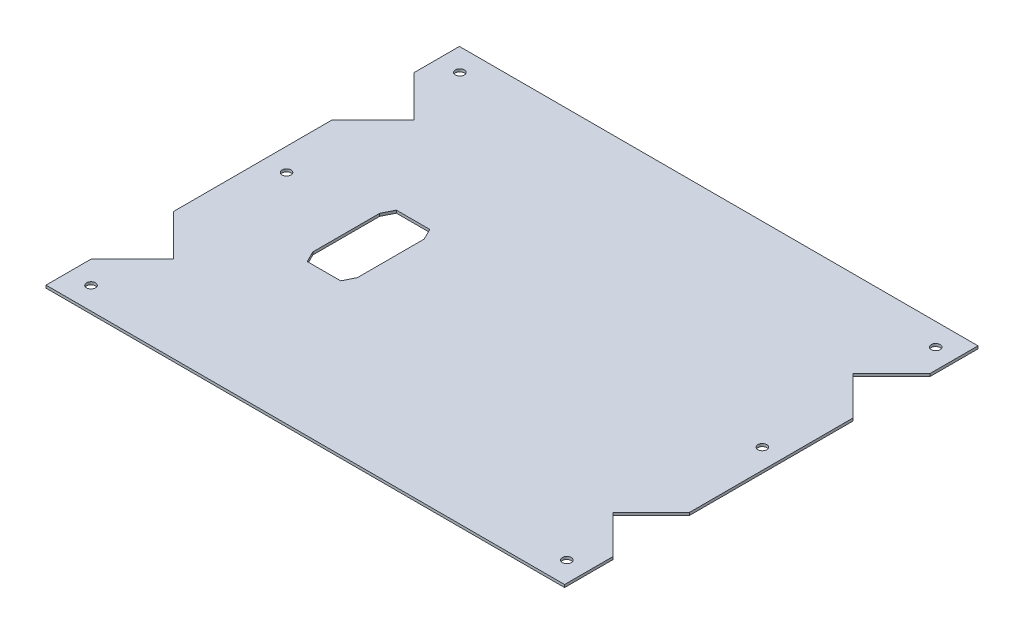
ISO-10303-21;
HEADER;
FILE_DESCRIPTION(('STEP AP214'),'2;1');
FILE_NAME('part.step','',(''),(''),'','','');
FILE_SCHEMA(('AUTOMOTIVE_DESIGN { 1 0 10303 214 1 1 1 1 }'));
ENDSEC;
DATA;
#1=APPLICATION_CONTEXT('core data for automotive mechanical design processes');
#2=APPLICATION_PROTOCOL_DEFINITION('international standard','automotive_design',2000,#1);
#3=PRODUCT_CONTEXT('',#1,'mechanical');
#4=PRODUCT('Part','Part','',(#3));
#5=PRODUCT_RELATED_PRODUCT_CATEGORY('part','',(#4));
#6=PRODUCT_DEFINITION_FORMATION('','',#4);
#7=PRODUCT_DEFINITION_CONTEXT('part definition',#1,'design');
#8=PRODUCT_DEFINITION('design','',#6,#7);
#9=PRODUCT_DEFINITION_SHAPE('','',#8);
#10=(LENGTH_UNIT() NAMED_UNIT(*) SI_UNIT(.MILLI.,.METRE.));
#11=(NAMED_UNIT(*) PLANE_ANGLE_UNIT() SI_UNIT($,.RADIAN.));
#12=(NAMED_UNIT(*) SI_UNIT($,.STERADIAN.) SOLID_ANGLE_UNIT());
#13=UNCERTAINTY_MEASURE_WITH_UNIT(LENGTH_MEASURE(1.E-05),#10,'distance_accuracy_value','');
#14=(GEOMETRIC_REPRESENTATION_CONTEXT(3) GLOBAL_UNCERTAINTY_ASSIGNED_CONTEXT((#13)) GLOBAL_UNIT_ASSIGNED_CONTEXT((#10,
#11,#12)) REPRESENTATION_CONTEXT('',''));
#15=CARTESIAN_POINT('',(0.,0.,0.));
#16=DIRECTION('',(0.,0.,1.));
#17=DIRECTION('',(1.,0.,0.));
#18=AXIS2_PLACEMENT_3D('',#15,#16,#17);
#19=CARTESIAN_POINT('',(0.,1.2,0.));
#20=DIRECTION('',(0.,-1.,0.));
#21=DIRECTION('',(0.,0.,-1.));
#22=AXIS2_PLACEMENT_3D('',#19,#20,#21);
#23=PLANE('',#22);
#24=DIRECTION('',(0.707106781186555,0.,0.70710678118654));
#25=VECTOR('',#24,1.);
#26=CARTESIAN_POINT('',(-8.29720542096546,1.19999999999937,-10.8767766953194));
#27=LINE('',#26,#25);
#28=CARTESIAN_POINT('',(-16.9739821162847,1.19999999999928,-19.5535533906384));
#29=VERTEX_POINT('',#28);
#30=CARTESIAN_POINT('',(1.46656233249632,1.19999999999947,-1.1130089418578));
#31=VERTEX_POINT('',#30);
#32=EDGE_CURVE('E726',#29,#31,#27,.T.);
#33=ORIENTED_EDGE('',*,*,#32,.T.);
#34=DIRECTION('',(-0.707106781186548,0.,0.707106781186547));
#35=VECTOR('',#34,1.);
#36=CARTESIAN_POINT('',(-27.1972054209779,1.19999999999882,27.5507588116164));
#37=LINE('',#36,#35);
#38=CARTESIAN_POINT('',(-16.9739821162848,1.19999999999885,17.3275355069233));
#39=VERTEX_POINT('',#38);
#40=EDGE_CURVE('E614',#31,#39,#37,.T.);
#41=ORIENTED_EDGE('',*,*,#40,.T.);
#42=DIRECTION('',(0.,0.,1.));
#43=VECTOR('',#42,1.);
#44=CARTESIAN_POINT('',(-16.9739821162848,1.19999999999878,37.7739821163095));
#45=LINE('',#44,#43);
#46=CARTESIAN_POINT('',(-16.9739821162848,1.19999999999878,37.7739821163095));
#47=VERTEX_POINT('',#46);
#48=EDGE_CURVE('E628',#47,#39,#45,.F.);
#49=ORIENTED_EDGE('',*,*,#48,.F.);
#50=DIRECTION('',(1.,0.,0.));
#51=VECTOR('',#50,1.);
#52=CARTESIAN_POINT('',(215.773982116274,1.19999999999876,37.7739821163095));
#53=LINE('',#52,#51);
#54=CARTESIAN_POINT('',(215.773982116274,1.19999999999876,37.7739821163092));
#55=VERTEX_POINT('',#54);
#56=EDGE_CURVE('E617',#47,#55,#53,.T.);
#57=ORIENTED_EDGE('',*,*,#56,.T.);
#58=DIRECTION('',(0.,0.,-1.));
#59=VECTOR('',#58,1.);
#60=CARTESIAN_POINT('',(215.773982116274,1.19999999999956,-0.0260178836905514));
#61=LINE('',#60,#59);
#62=CARTESIAN_POINT('',(215.773982116274,1.19999999999923,16.1275355069061));
#63=VERTEX_POINT('',#62);
#64=EDGE_CURVE('E637',#63,#55,#61,.F.);
#65=ORIENTED_EDGE('',*,*,#64,.F.);
#66=DIRECTION('',(-0.70710678118656,0.,-0.707106781186535));
#67=VECTOR('',#66,1.);
#68=CARTESIAN_POINT('',(207.697205420976,1.19999999999942,8.05075881160807));
#69=LINE('',#68,#67);
#70=CARTESIAN_POINT('',(198.533437667526,1.19999999999961,-1.11300894184206));
#71=VERTEX_POINT('',#70);
#72=EDGE_CURVE('E620',#63,#71,#69,.T.);
#73=ORIENTED_EDGE('',*,*,#72,.T.);
#74=DIRECTION('',(0.707106781186543,0.,-0.707106781186552));
#75=VECTOR('',#74,1.);
#76=CARTESIAN_POINT('',(260.497205420979,1.1999999999997,-63.0767766952964));
#77=LINE('',#76,#75);
#78=CARTESIAN_POINT('',(215.773982116275,1.19999999999945,-18.3535533905913));
#79=VERTEX_POINT('',#78);
#80=EDGE_CURVE('E700',#71,#79,#77,.T.);
#81=ORIENTED_EDGE('',*,*,#80,.T.);
#82=DIRECTION('',(0.,0.,-1.));
#83=VECTOR('',#82,1.);
#84=CARTESIAN_POINT('',(215.773982116275,1.20000000000006,-107.8));
#85=LINE('',#84,#83);
#86=CARTESIAN_POINT('',(215.773982116275,1.19999999999995,-91.6464466094031));
#87=VERTEX_POINT('',#86);
#88=EDGE_CURVE('E709',#87,#79,#85,.F.);
#89=ORIENTED_EDGE('',*,*,#88,.F.);
#90=DIRECTION('',(-0.707106781186554,0.,-0.707106781186541));
#91=VECTOR('',#90,1.);
#92=CARTESIAN_POINT('',(207.697205420976,1.20000000000003,-99.7232233047014));
#93=LINE('',#92,#91);
#94=CARTESIAN_POINT('',(198.533437667532,1.20000000000009,-108.886991058146));
#95=VERTEX_POINT('',#94);
#96=EDGE_CURVE('E698',#87,#95,#93,.T.);
#97=ORIENTED_EDGE('',*,*,#96,.T.);
#98=DIRECTION('',(0.707106781186549,0.,-0.707106781186546));
#99=VECTOR('',#98,1.);
#100=CARTESIAN_POINT('',(226.597205420989,1.19999999999951,-136.950758811603));
#101=LINE('',#100,#99);
#102=CARTESIAN_POINT('',(215.773982116275,1.19999999999962,-126.127535506889));
#103=VERTEX_POINT('',#102);
#104=EDGE_CURVE('E593',#95,#103,#101,.T.);
#105=ORIENTED_EDGE('',*,*,#104,.T.);
#106=DIRECTION('',(0.,0.,-1.));
#107=VECTOR('',#106,1.);
#108=CARTESIAN_POINT('',(215.773982116275,1.19999999999947,-147.773982116317));
#109=LINE('',#108,#107);
#110=CARTESIAN_POINT('',(215.773982116275,1.19999999999947,-147.773982116317));
#111=VERTEX_POINT('',#110);
#112=EDGE_CURVE('E663',#111,#103,#109,.F.);
#113=ORIENTED_EDGE('',*,*,#112,.F.);
#114=DIRECTION('',(1.,0.,0.));
#115=VECTOR('',#114,1.);
#116=CARTESIAN_POINT('',(215.773982116275,1.19999999999947,-147.773982116317));
#117=LINE('',#116,#115);
#118=CARTESIAN_POINT('',(-16.9739821162845,1.19999999999817,-147.773982116316));
#119=VERTEX_POINT('',#118);
#120=EDGE_CURVE('E659',#111,#119,#117,.F.);
#121=ORIENTED_EDGE('',*,*,#120,.T.);
#122=DIRECTION('',(0.,0.,1.));
#123=VECTOR('',#122,1.);
#124=CARTESIAN_POINT('',(-16.9739821162845,1.19999999999909,-109.973982116317));
#125=LINE('',#124,#123);
#126=CARTESIAN_POINT('',(-16.9739821162845,1.19999999999867,-127.327535506915));
#127=VERTEX_POINT('',#126);
#128=EDGE_CURVE('E674',#127,#119,#125,.F.);
#129=ORIENTED_EDGE('',*,*,#128,.F.);
#130=DIRECTION('',(0.707106781186561,0.,0.707106781186534));
#131=VECTOR('',#130,1.);
#132=CARTESIAN_POINT('',(-8.29720542098548,1.19999999999888,-118.650758811616));
#133=LINE('',#132,#131);
#134=CARTESIAN_POINT('',(1.46656233246933,1.19999999999911,-108.886991058161));
#135=VERTEX_POINT('',#134);
#136=EDGE_CURVE('E657',#127,#135,#133,.T.);
#137=ORIENTED_EDGE('',*,*,#136,.T.);
#138=DIRECTION('',(-0.707106781186541,0.,0.707106781186554));
#139=VECTOR('',#138,1.);
#140=CARTESIAN_POINT('',(-61.0972054209882,1.19999999999901,-46.3232233047028));
#141=LINE('',#140,#139);
#142=CARTESIAN_POINT('',(-16.9739821162847,1.19999999999854,-90.4464466094071));
#143=VERTEX_POINT('',#142);
#144=EDGE_CURVE('E728',#135,#143,#141,.T.);
#145=ORIENTED_EDGE('',*,*,#144,.T.);
#146=DIRECTION('',(0.,0.,1.));
#147=VECTOR('',#146,1.);
#148=CARTESIAN_POINT('',(-16.9739821162847,1.19999999999947,-2.2));
#149=LINE('',#148,#147);
#150=EDGE_CURVE('E734',#29,#143,#149,.F.);
#151=ORIENTED_EDGE('',*,*,#150,.F.);
#152=EDGE_LOOP('',(#33,#41,#49,#57,#65,#73,#81,#89,#97,#105,#113,#121,#129,#137,#145,#151));
#153=FACE_BOUND('',#152,.T.);
#154=DIRECTION('',(-0.447213595499958,0.,0.894427190999916));
#155=VECTOR('',#154,1.);
#156=CARTESIAN_POINT('',(30.,1.2,-65.));
#157=LINE('',#156,#155);
#158=CARTESIAN_POINT('',(32.5,1.2,-70.));
#159=VERTEX_POINT('',#158);
#160=CARTESIAN_POINT('',(30.,1.2,-65.));
#161=VERTEX_POINT('',#160);
#162=EDGE_CURVE('E738',#159,#161,#157,.T.);
#163=ORIENTED_EDGE('',*,*,#162,.F.);
#164=DIRECTION('',(-1.,0.,0.));
#165=VECTOR('',#164,1.);
#166=CARTESIAN_POINT('',(32.5,1.2,-70.));
#167=LINE('',#166,#165);
#168=CARTESIAN_POINT('',(47.5,1.2,-70.));
#169=VERTEX_POINT('',#168);
#170=EDGE_CURVE('E753',#169,#159,#167,.T.);
#171=ORIENTED_EDGE('',*,*,#170,.F.);
#172=DIRECTION('',(-0.447213595499958,0.,-0.894427190999916));
#173=VECTOR('',#172,1.);
#174=CARTESIAN_POINT('',(47.5,1.2,-70.));
#175=LINE('',#174,#173);
#176=CARTESIAN_POINT('',(50.,1.2,-65.));
#177=VERTEX_POINT('',#176);
#178=EDGE_CURVE('E751',#177,#169,#175,.T.);
#179=ORIENTED_EDGE('',*,*,#178,.F.);
#180=DIRECTION('',(0.,0.,-1.));
#181=VECTOR('',#180,1.);
#182=CARTESIAN_POINT('',(50.,1.2,-65.));
#183=LINE('',#182,#181);
#184=CARTESIAN_POINT('',(50.,1.2,-35.));
#185=VERTEX_POINT('',#184);
#186=EDGE_CURVE('E749',#185,#177,#183,.T.);
#187=ORIENTED_EDGE('',*,*,#186,.F.);
#188=DIRECTION('',(0.447213595499959,0.,-0.894427190999915));
#189=VECTOR('',#188,1.);
#190=CARTESIAN_POINT('',(50.,1.2,-35.));
#191=LINE('',#190,#189);
#192=CARTESIAN_POINT('',(47.5,1.2,-30.));
#193=VERTEX_POINT('',#192);
#194=EDGE_CURVE('E747',#193,#185,#191,.T.);
#195=ORIENTED_EDGE('',*,*,#194,.F.);
#196=DIRECTION('',(1.,0.,0.));
#197=VECTOR('',#196,1.);
#198=CARTESIAN_POINT('',(47.5,1.2,-30.));
#199=LINE('',#198,#197);
#200=CARTESIAN_POINT('',(32.5,1.2,-30.));
#201=VERTEX_POINT('',#200);
#202=EDGE_CURVE('E745',#201,#193,#199,.T.);
#203=ORIENTED_EDGE('',*,*,#202,.F.);
#204=DIRECTION('',(0.447213595499958,0.,0.894427190999916));
#205=VECTOR('',#204,1.);
#206=CARTESIAN_POINT('',(32.5,1.2,-30.));
#207=LINE('',#206,#205);
#208=CARTESIAN_POINT('',(30.,1.2,-35.));
#209=VERTEX_POINT('',#208);
#210=EDGE_CURVE('E743',#209,#201,#207,.T.);
#211=ORIENTED_EDGE('',*,*,#210,.F.);
#212=DIRECTION('',(0.,0.,1.));
#213=VECTOR('',#212,1.);
#214=CARTESIAN_POINT('',(30.,1.2,-65.));
#215=LINE('',#214,#213);
#216=EDGE_CURVE('E740',#161,#209,#215,.T.);
#217=ORIENTED_EDGE('',*,*,#216,.F.);
#218=EDGE_LOOP('',(#163,#171,#179,#187,#195,#203,#211,#217));
#219=FACE_BOUND('',#218,.T.);
#220=CARTESIAN_POINT('',(-6.77398211619506,1.19999999999886,-59.9999999999999));
#221=DIRECTION('',(0.,1.,0.));
#222=DIRECTION('',(-1.,0.,0.));
#223=AXIS2_PLACEMENT_3D('',#220,#221,#222);
#224=CIRCLE('',#223,2.);
#225=CARTESIAN_POINT('',(-8.77398211619506,1.19999999999886,-59.9999999999999));
#226=VERTEX_POINT('',#225);
#227=EDGE_CURVE('E731',#226,#226,#224,.T.);
#228=ORIENTED_EDGE('',*,*,#227,.F.);
#229=EDGE_LOOP('',(#228));
#230=FACE_BOUND('',#229,.T.);
#231=CARTESIAN_POINT('',(206.773982116275,1.19999999999978,-60.0000000000001));
#232=DIRECTION('',(0.,1.,0.));
#233=DIRECTION('',(-1.,0.,0.));
#234=AXIS2_PLACEMENT_3D('',#231,#232,#233);
#235=CIRCLE('',#234,2.);
#236=CARTESIAN_POINT('',(204.773982116275,1.19999999999979,-60.));
#237=VERTEX_POINT('',#236);
#238=EDGE_CURVE('E706',#237,#237,#235,.T.);
#239=ORIENTED_EDGE('',*,*,#238,.F.);
#240=EDGE_LOOP('',(#239));
#241=FACE_BOUND('',#240,.T.);
#242=CARTESIAN_POINT('',(-6.77398211628509,1.19999999999841,-137.773982116225));
#243=DIRECTION('',(0.,1.,0.));
#244=DIRECTION('',(1.,0.,0.));
#245=AXIS2_PLACEMENT_3D('',#242,#243,#244);
#246=CIRCLE('',#245,2.);
#247=CARTESIAN_POINT('',(-4.77398211628509,1.19999999999841,-137.773982116225));
#248=VERTEX_POINT('',#247);
#249=EDGE_CURVE('E684',#248,#248,#246,.T.);
#250=ORIENTED_EDGE('',*,*,#249,.F.);
#251=EDGE_LOOP('',(#250));
#252=FACE_BOUND('',#251,.T.);
#253=CARTESIAN_POINT('',(206.773982116274,1.19999999999952,-137.773982116316));
#254=DIRECTION('',(0.,1.,0.));
#255=DIRECTION('',(1.,0.,0.));
#256=AXIS2_PLACEMENT_3D('',#253,#254,#255);
#257=CIRCLE('',#256,2.);
#258=CARTESIAN_POINT('',(208.773982116274,1.19999999999952,-137.773982116316));
#259=VERTEX_POINT('',#258);
#260=EDGE_CURVE('E608',#259,#259,#257,.T.);
#261=ORIENTED_EDGE('',*,*,#260,.F.);
#262=EDGE_LOOP('',(#261));
#263=FACE_BOUND('',#262,.T.);
#264=CARTESIAN_POINT('',(-6.77398211628492,1.19999999999881,27.7739821162591));
#265=DIRECTION('',(0.,1.,0.));
#266=DIRECTION('',(-1.,0.,0.));
#267=AXIS2_PLACEMENT_3D('',#264,#265,#266);
#268=CIRCLE('',#267,2.);
#269=CARTESIAN_POINT('',(-8.77398211628492,1.19999999999881,27.7739821162591));
#270=VERTEX_POINT('',#269);
#271=EDGE_CURVE('E642',#270,#270,#268,.T.);
#272=ORIENTED_EDGE('',*,*,#271,.F.);
#273=EDGE_LOOP('',(#272));
#274=FACE_BOUND('',#273,.T.);
#275=CARTESIAN_POINT('',(206.773982116274,1.19999999999899,27.7739821163497));
#276=DIRECTION('',(0.,1.,0.));
#277=DIRECTION('',(-1.,0.,0.));
#278=AXIS2_PLACEMENT_3D('',#275,#276,#277);
#279=CIRCLE('',#278,2.);
#280=CARTESIAN_POINT('',(204.773982116274,1.19999999999899,27.7739821163497));
#281=VERTEX_POINT('',#280);
#282=EDGE_CURVE('E605',#281,#281,#279,.T.);
#283=ORIENTED_EDGE('',*,*,#282,.F.);
#284=EDGE_LOOP('',(#283));
#285=FACE_BOUND('',#284,.T.);
#286=ADVANCED_FACE('F403',(#153,#219,#230,#241,#252,#263,#274,#285),#23,.F.);
#287=CARTESIAN_POINT('',(0.,0.,0.));
#288=DIRECTION('',(0.,-1.,0.));
#289=DIRECTION('',(0.,0.,-1.));
#290=AXIS2_PLACEMENT_3D('',#287,#288,#289);
#291=PLANE('',#290);
#292=DIRECTION('',(-0.707106781186548,0.,0.707106781186547));
#293=VECTOR('',#292,1.);
#294=CARTESIAN_POINT('',(-27.1972054209779,-1.18326433589518E-12,27.5507588116164));
#295=LINE('',#294,#293);
#296=CARTESIAN_POINT('',(1.46656233249632,-5.26488574958961E-13,-1.11300894185779));
#297=VERTEX_POINT('',#296);
#298=CARTESIAN_POINT('',(-16.9739821162848,-1.14996634274895E-12,17.3275355069233));
#299=VERTEX_POINT('',#298);
#300=EDGE_CURVE('E609',#297,#299,#295,.T.);
#301=ORIENTED_EDGE('',*,*,#300,.F.);
#302=DIRECTION('',(0.707106781186555,0.,0.70710678118654));
#303=VECTOR('',#302,1.);
#304=CARTESIAN_POINT('',(-8.29720542096546,-6.27261134604597E-13,-10.8767766953194));
#305=LINE('',#304,#303);
#306=CARTESIAN_POINT('',(-16.9739821162847,-7.17145081250211E-13,-19.5535533906384));
#307=VERTEX_POINT('',#306);
#308=EDGE_CURVE('E713',#307,#297,#305,.T.);
#309=ORIENTED_EDGE('',*,*,#308,.F.);
#310=DIRECTION('',(0.,0.,1.));
#311=VECTOR('',#310,1.);
#312=CARTESIAN_POINT('',(-16.9739821162847,-5.34579865802318E-13,-2.19999999999999));
#313=LINE('',#312,#311);
#314=CARTESIAN_POINT('',(-16.9739821162847,-1.46296215011584E-12,-90.4464466094071));
#315=VERTEX_POINT('',#314);
#316=EDGE_CURVE('E715',#307,#315,#313,.F.);
#317=ORIENTED_EDGE('',*,*,#316,.T.);
#318=DIRECTION('',(-0.707106781186541,0.,0.707106781186554));
#319=VECTOR('',#318,1.);
#320=CARTESIAN_POINT('',(-61.0972054209882,-9.91081909756227E-13,-46.3232233047028));
#321=LINE('',#320,#319);
#322=CARTESIAN_POINT('',(1.46656233246933,-8.85793174920657E-13,-108.886991058161));
#323=VERTEX_POINT('',#322);
#324=EDGE_CURVE('E723',#323,#315,#321,.T.);
#325=ORIENTED_EDGE('',*,*,#324,.F.);
#326=DIRECTION('',(0.707106781186561,0.,0.707106781186534));
#327=VECTOR('',#326,1.);
#328=CARTESIAN_POINT('',(-8.29720542098548,-1.12410081243297E-12,-118.650758811616));
#329=LINE('',#328,#327);
#330=CARTESIAN_POINT('',(-16.9739821162845,-1.33226762955019E-12,-127.327535506915));
#331=VERTEX_POINT('',#330);
#332=EDGE_CURVE('E588',#331,#323,#329,.T.);
#333=ORIENTED_EDGE('',*,*,#332,.F.);
#334=DIRECTION('',(0.,0.,1.));
#335=VECTOR('',#334,1.);
#336=CARTESIAN_POINT('',(-16.9739821162845,-9.15933995315754E-13,-109.973982116317));
#337=LINE('',#336,#335);
#338=CARTESIAN_POINT('',(-16.9739821162845,-1.83186799063151E-12,-147.773982116316));
#339=VERTEX_POINT('',#338);
#340=EDGE_CURVE('E668',#331,#339,#337,.F.);
#341=ORIENTED_EDGE('',*,*,#340,.T.);
#342=DIRECTION('',(1.,0.,0.));
#343=VECTOR('',#342,1.);
#344=CARTESIAN_POINT('',(215.773982116275,-5.41233724504764E-13,-147.773982116317));
#345=LINE('',#344,#343);
#346=CARTESIAN_POINT('',(215.773982116275,-5.41233724504764E-13,-147.773982116317));
#347=VERTEX_POINT('',#346);
#348=EDGE_CURVE('E682',#347,#339,#345,.F.);
#349=ORIENTED_EDGE('',*,*,#348,.F.);
#350=DIRECTION('',(0.,0.,-1.));
#351=VECTOR('',#350,1.);
#352=CARTESIAN_POINT('',(215.773982116275,-5.41233724504764E-13,-147.773982116317));
#353=LINE('',#352,#351);
#354=CARTESIAN_POINT('',(215.773982116275,-3.88578058618805E-13,-126.127535506889));
#355=VERTEX_POINT('',#354);
#356=EDGE_CURVE('E585',#347,#355,#353,.F.);
#357=ORIENTED_EDGE('',*,*,#356,.T.);
#358=DIRECTION('',(0.707106781186549,0.,-0.707106781186546));
#359=VECTOR('',#358,1.);
#360=CARTESIAN_POINT('',(226.597205420989,-4.9960036108132E-13,-136.950758811603));
#361=LINE('',#360,#359);
#362=CARTESIAN_POINT('',(198.533437667532,0.,-108.886991058146));
#363=VERTEX_POINT('',#362);
#364=EDGE_CURVE('E580',#363,#355,#361,.T.);
#365=ORIENTED_EDGE('',*,*,#364,.F.);
#366=DIRECTION('',(-0.707106781186554,0.,-0.707106781186541));
#367=VECTOR('',#366,1.);
#368=CARTESIAN_POINT('',(207.697205420976,0.,-99.7232233047014));
#369=LINE('',#368,#367);
#370=CARTESIAN_POINT('',(215.773982116275,0.,-91.6464466094032));
#371=VERTEX_POINT('',#370);
#372=EDGE_CURVE('E565',#371,#363,#369,.T.);
#373=ORIENTED_EDGE('',*,*,#372,.F.);
#374=DIRECTION('',(0.,0.,-1.));
#375=VECTOR('',#374,1.);
#376=CARTESIAN_POINT('',(215.773982116275,0.,-107.8));
#377=LINE('',#376,#375);
#378=CARTESIAN_POINT('',(215.773982116275,-5.55111512312578E-13,-18.3535533905913));
#379=VERTEX_POINT('',#378);
#380=EDGE_CURVE('E576',#371,#379,#377,.F.);
#381=ORIENTED_EDGE('',*,*,#380,.T.);
#382=DIRECTION('',(0.707106781186543,0.,-0.707106781186552));
#383=VECTOR('',#382,1.);
#384=CARTESIAN_POINT('',(260.497205420979,-3.05311331771918E-13,-63.0767766952964));
#385=LINE('',#384,#383);
#386=CARTESIAN_POINT('',(198.533437667526,-3.94215909915729E-13,-1.11300894184208));
#387=VERTEX_POINT('',#386);
#388=EDGE_CURVE('E695',#387,#379,#385,.T.);
#389=ORIENTED_EDGE('',*,*,#388,.F.);
#390=DIRECTION('',(-0.70710678118656,0.,-0.707106781186535));
#391=VECTOR('',#390,1.);
#392=CARTESIAN_POINT('',(207.697205420976,-5.85571675505244E-13,8.05075881160805));
#393=LINE('',#392,#391);
#394=CARTESIAN_POINT('',(215.773982116274,-7.80305044308654E-13,16.1275355069061));
#395=VERTEX_POINT('',#394);
#396=EDGE_CURVE('E612',#395,#387,#393,.T.);
#397=ORIENTED_EDGE('',*,*,#396,.F.);
#398=DIRECTION('',(0.,0.,-1.));
#399=VECTOR('',#398,1.);
#400=CARTESIAN_POINT('',(215.773982116274,-4.4634945793309E-13,-0.0260178836905766));
#401=LINE('',#400,#399);
#402=CARTESIAN_POINT('',(215.773982116274,-1.24446126731645E-12,37.7739821163091));
#403=VERTEX_POINT('',#402);
#404=EDGE_CURVE('E634',#395,#403,#401,.F.);
#405=ORIENTED_EDGE('',*,*,#404,.T.);
#406=DIRECTION('',(1.,0.,0.));
#407=VECTOR('',#406,1.);
#408=CARTESIAN_POINT('',(215.773982116274,-1.24446126731645E-12,37.7739821163095));
#409=LINE('',#408,#407);
#410=CARTESIAN_POINT('',(-16.9739821162848,-1.22041639802509E-12,37.7739821163095));
#411=VERTEX_POINT('',#410);
#412=EDGE_CURVE('E647',#411,#403,#409,.T.);
#413=ORIENTED_EDGE('',*,*,#412,.F.);
#414=DIRECTION('',(0.,0.,1.));
#415=VECTOR('',#414,1.);
#416=CARTESIAN_POINT('',(-16.9739821162848,-1.22041639802509E-12,37.7739821163095));
#417=LINE('',#416,#415);
#418=EDGE_CURVE('E622',#411,#299,#417,.F.);
#419=ORIENTED_EDGE('',*,*,#418,.T.);
#420=EDGE_LOOP('',(#301,#309,#317,#325,#333,#341,#349,#357,#365,#373,#381,#389,#397,#405,#413,#419));
#421=FACE_BOUND('',#420,.T.);
#422=DIRECTION('',(-1.,0.,0.));
#423=VECTOR('',#422,1.);
#424=CARTESIAN_POINT('',(32.5,0.,-70.));
#425=LINE('',#424,#423);
#426=CARTESIAN_POINT('',(47.5,0.,-70.));
#427=VERTEX_POINT('',#426);
#428=CARTESIAN_POINT('',(32.5,0.,-70.));
#429=VERTEX_POINT('',#428);
#430=EDGE_CURVE('E741',#427,#429,#425,.T.);
#431=ORIENTED_EDGE('',*,*,#430,.T.);
#432=DIRECTION('',(-0.447213595499958,0.,0.894427190999916));
#433=VECTOR('',#432,1.);
#434=CARTESIAN_POINT('',(30.,0.,-65.));
#435=LINE('',#434,#433);
#436=CARTESIAN_POINT('',(30.,0.,-65.));
#437=VERTEX_POINT('',#436);
#438=EDGE_CURVE('E425',#429,#437,#435,.T.);
#439=ORIENTED_EDGE('',*,*,#438,.T.);
#440=DIRECTION('',(0.,0.,1.));
#441=VECTOR('',#440,1.);
#442=CARTESIAN_POINT('',(30.,0.,-65.));
#443=LINE('',#442,#441);
#444=CARTESIAN_POINT('',(30.,0.,-35.));
#445=VERTEX_POINT('',#444);
#446=EDGE_CURVE('E757',#437,#445,#443,.T.);
#447=ORIENTED_EDGE('',*,*,#446,.T.);
#448=DIRECTION('',(0.447213595499958,0.,0.894427190999916));
#449=VECTOR('',#448,1.);
#450=CARTESIAN_POINT('',(32.5,0.,-30.));
#451=LINE('',#450,#449);
#452=CARTESIAN_POINT('',(32.5,0.,-30.));
#453=VERTEX_POINT('',#452);
#454=EDGE_CURVE('E760',#445,#453,#451,.T.);
#455=ORIENTED_EDGE('',*,*,#454,.T.);
#456=DIRECTION('',(1.,0.,0.));
#457=VECTOR('',#456,1.);
#458=CARTESIAN_POINT('',(47.5,0.,-30.));
#459=LINE('',#458,#457);
#460=CARTESIAN_POINT('',(47.5,0.,-30.));
#461=VERTEX_POINT('',#460);
#462=EDGE_CURVE('E763',#453,#461,#459,.T.);
#463=ORIENTED_EDGE('',*,*,#462,.T.);
#464=DIRECTION('',(0.447213595499959,0.,-0.894427190999915));
#465=VECTOR('',#464,1.);
#466=CARTESIAN_POINT('',(50.,0.,-35.));
#467=LINE('',#466,#465);
#468=CARTESIAN_POINT('',(50.,0.,-35.));
#469=VERTEX_POINT('',#468);
#470=EDGE_CURVE('E766',#461,#469,#467,.T.);
#471=ORIENTED_EDGE('',*,*,#470,.T.);
#472=DIRECTION('',(0.,0.,-1.));
#473=VECTOR('',#472,1.);
#474=CARTESIAN_POINT('',(50.,0.,-65.));
#475=LINE('',#474,#473);
#476=CARTESIAN_POINT('',(50.,0.,-65.));
#477=VERTEX_POINT('',#476);
#478=EDGE_CURVE('E769',#469,#477,#475,.T.);
#479=ORIENTED_EDGE('',*,*,#478,.T.);
#480=DIRECTION('',(-0.447213595499958,0.,-0.894427190999916));
#481=VECTOR('',#480,1.);
#482=CARTESIAN_POINT('',(47.5,0.,-70.));
#483=LINE('',#482,#481);
#484=EDGE_CURVE('E772',#477,#427,#483,.T.);
#485=ORIENTED_EDGE('',*,*,#484,.T.);
#486=EDGE_LOOP('',(#431,#439,#447,#455,#463,#471,#479,#485));
#487=FACE_BOUND('',#486,.T.);
#488=CARTESIAN_POINT('',(-6.77398211619451,-5.28102903748392E-12,-59.9999999999999));
#489=DIRECTION('',(-4.58830951171779E-13,1.,0.));
#490=DIRECTION('',(-1.,-4.58830951171779E-13,0.));
#491=AXIS2_PLACEMENT_3D('',#488,#489,#490);
#492=CIRCLE('',#491,2.);
#493=CARTESIAN_POINT('',(-8.77398211619452,-6.19869093982748E-12,-59.9999999999999));
#494=VERTEX_POINT('',#493);
#495=EDGE_CURVE('E718',#494,#494,#492,.T.);
#496=ORIENTED_EDGE('',*,*,#495,.T.);
#497=EDGE_LOOP('',(#496));
#498=FACE_BOUND('',#497,.T.);
#499=CARTESIAN_POINT('',(206.773982116276,9.6034291630076E-12,-60.0000000000001));
#500=DIRECTION('',(1.08978213844371E-12,-1.,0.));
#501=DIRECTION('',(1.,1.08978213844371E-12,0.));
#502=AXIS2_PLACEMENT_3D('',#499,#500,#501);
#503=CIRCLE('',#502,2.);
#504=CARTESIAN_POINT('',(208.773982116276,1.1782993439895E-11,-60.0000000000001));
#505=VERTEX_POINT('',#504);
#506=EDGE_CURVE('E703',#505,#505,#503,.T.);
#507=ORIENTED_EDGE('',*,*,#506,.F.);
#508=EDGE_LOOP('',(#507));
#509=FACE_BOUND('',#508,.T.);
#510=CARTESIAN_POINT('',(206.773982116275,1.89709359332824E-11,-137.773982116317));
#511=DIRECTION('',(6.30889954931976E-13,-1.,-4.51729329736964E-13));
#512=DIRECTION('',(0.,4.51729329736966E-13,-1.));
#513=AXIS2_PLACEMENT_3D('',#510,#511,#512);
#514=CIRCLE('',#513,2.);
#515=CARTESIAN_POINT('',(206.773982116275,1.98743945927563E-11,-139.773982116317));
#516=VERTEX_POINT('',#515);
#517=EDGE_CURVE('E687',#516,#516,#514,.T.);
#518=ORIENTED_EDGE('',*,*,#517,.F.);
#519=EDGE_LOOP('',(#518));
#520=FACE_BOUND('',#519,.T.);
#521=CARTESIAN_POINT('',(-6.77398211628509,-1.53627111032506E-11,-137.773982116225));
#522=DIRECTION('',(0.,1.,-4.83378445039087E-13));
#523=DIRECTION('',(0.,-4.83378445039087E-13,-1.));
#524=AXIS2_PLACEMENT_3D('',#521,#522,#523);
#525=CIRCLE('',#524,2.);
#526=CARTESIAN_POINT('',(-6.77398211628513,-1.63294679933288E-11,-139.773982116225));
#527=VERTEX_POINT('',#526);
#528=EDGE_CURVE('E671',#527,#527,#525,.T.);
#529=ORIENTED_EDGE('',*,*,#528,.T.);
#530=EDGE_LOOP('',(#529));
#531=FACE_BOUND('',#530,.T.);
#532=CARTESIAN_POINT('',(-6.77398211628492,-1.49555189857554E-11,27.7739821162586));
#533=DIRECTION('',(0.,1.,4.6233777269513E-13));
#534=DIRECTION('',(0.,-4.6233777269513E-13,1.));
#535=AXIS2_PLACEMENT_3D('',#532,#533,#534);
#536=CIRCLE('',#535,2.);
#537=CARTESIAN_POINT('',(-6.77398211628492,-1.58801945311457E-11,29.7739821162586));
#538=VERTEX_POINT('',#537);
#539=EDGE_CURVE('E625',#538,#538,#536,.T.);
#540=ORIENTED_EDGE('',*,*,#539,.T.);
#541=EDGE_LOOP('',(#540));
#542=FACE_BOUND('',#541,.T.);
#543=CARTESIAN_POINT('',(206.773982116275,1.84414010819371E-11,27.7739821163502));
#544=DIRECTION('',(6.30889954931976E-13,-1.,4.38123186575764E-13));
#545=DIRECTION('',(0.,4.38123186575775E-13,1.));
#546=AXIS2_PLACEMENT_3D('',#543,#544,#545);
#547=CIRCLE('',#546,2.);
#548=CARTESIAN_POINT('',(206.773982116275,1.93176474550887E-11,29.7739821163502));
#549=VERTEX_POINT('',#548);
#550=EDGE_CURVE('E650',#549,#549,#547,.T.);
#551=ORIENTED_EDGE('',*,*,#550,.F.);
#552=EDGE_LOOP('',(#551));
#553=FACE_BOUND('',#552,.T.);
#554=ADVANCED_FACE('F405',(#421,#487,#498,#509,#520,#531,#542,#553),#291,.T.);
#555=CARTESIAN_POINT('',(30.,1.2,-65.));
#556=DIRECTION('',(0.894427190999916,0.,0.447213595499958));
#557=DIRECTION('',(0.447213595499958,0.,-0.894427190999916));
#558=AXIS2_PLACEMENT_3D('',#555,#556,#557);
#559=PLANE('',#558);
#560=ORIENTED_EDGE('',*,*,#438,.F.);
#561=DIRECTION('',(0.,-1.,0.));
#562=VECTOR('',#561,1.);
#563=CARTESIAN_POINT('',(32.5,1.2,-70.));
#564=LINE('',#563,#562);
#565=EDGE_CURVE('E755',#159,#429,#564,.T.);
#566=ORIENTED_EDGE('',*,*,#565,.F.);
#567=ORIENTED_EDGE('',*,*,#162,.T.);
#568=DIRECTION('',(0.,-1.,0.));
#569=VECTOR('',#568,1.);
#570=CARTESIAN_POINT('',(30.,1.2,-65.));
#571=LINE('',#570,#569);
#572=EDGE_CURVE('E13',#161,#437,#571,.T.);
#573=ORIENTED_EDGE('',*,*,#572,.T.);
#574=EDGE_LOOP('',(#560,#566,#567,#573));
#575=FACE_BOUND('',#574,.T.);
#576=ADVANCED_FACE('F802',(#575),#559,.T.);
#577=CARTESIAN_POINT('',(30.,1.2,-65.));
#578=DIRECTION('',(1.,0.,0.));
#579=DIRECTION('',(0.,0.,-1.));
#580=AXIS2_PLACEMENT_3D('',#577,#578,#579);
#581=PLANE('',#580);
#582=ORIENTED_EDGE('',*,*,#446,.F.);
#583=ORIENTED_EDGE('',*,*,#572,.F.);
#584=ORIENTED_EDGE('',*,*,#216,.T.);
#585=DIRECTION('',(0.,-1.,0.));
#586=VECTOR('',#585,1.);
#587=CARTESIAN_POINT('',(30.,1.2,-35.));
#588=LINE('',#587,#586);
#589=EDGE_CURVE('E411',#209,#445,#588,.T.);
#590=ORIENTED_EDGE('',*,*,#589,.T.);
#591=EDGE_LOOP('',(#582,#583,#584,#590));
#592=FACE_BOUND('',#591,.T.);
#593=ADVANCED_FACE('F789',(#592),#581,.T.);
#594=CARTESIAN_POINT('',(32.5,1.2,-30.));
#595=DIRECTION('',(0.894427190999916,0.,-0.447213595499958));
#596=DIRECTION('',(-0.447213595499958,0.,-0.894427190999916));
#597=AXIS2_PLACEMENT_3D('',#594,#595,#596);
#598=PLANE('',#597);
#599=ORIENTED_EDGE('',*,*,#454,.F.);
#600=ORIENTED_EDGE('',*,*,#589,.F.);
#601=ORIENTED_EDGE('',*,*,#210,.T.);
#602=DIRECTION('',(0.,-1.,0.));
#603=VECTOR('',#602,1.);
#604=CARTESIAN_POINT('',(32.5,1.2,-30.));
#605=LINE('',#604,#603);
#606=EDGE_CURVE('E785',#201,#453,#605,.T.);
#607=ORIENTED_EDGE('',*,*,#606,.T.);
#608=EDGE_LOOP('',(#599,#600,#601,#607));
#609=FACE_BOUND('',#608,.T.);
#610=ADVANCED_FACE('F794',(#609),#598,.T.);
#611=CARTESIAN_POINT('',(47.5,1.2,-30.));
#612=DIRECTION('',(0.,0.,-1.));
#613=DIRECTION('',(-1.,0.,0.));
#614=AXIS2_PLACEMENT_3D('',#611,#612,#613);
#615=PLANE('',#614);
#616=ORIENTED_EDGE('',*,*,#462,.F.);
#617=ORIENTED_EDGE('',*,*,#606,.F.);
#618=ORIENTED_EDGE('',*,*,#202,.T.);
#619=DIRECTION('',(0.,-1.,0.));
#620=VECTOR('',#619,1.);
#621=CARTESIAN_POINT('',(47.5,1.2,-30.));
#622=LINE('',#621,#620);
#623=EDGE_CURVE('E783',#193,#461,#622,.T.);
#624=ORIENTED_EDGE('',*,*,#623,.T.);
#625=EDGE_LOOP('',(#616,#617,#618,#624));
#626=FACE_BOUND('',#625,.T.);
#627=ADVANCED_FACE('F809',(#626),#615,.T.);
#628=CARTESIAN_POINT('',(50.,1.2,-35.));
#629=DIRECTION('',(-0.894427190999915,0.,-0.447213595499959));
#630=DIRECTION('',(-0.447213595499959,0.,0.894427190999915));
#631=AXIS2_PLACEMENT_3D('',#628,#629,#630);
#632=PLANE('',#631);
#633=ORIENTED_EDGE('',*,*,#470,.F.);
#634=ORIENTED_EDGE('',*,*,#623,.F.);
#635=ORIENTED_EDGE('',*,*,#194,.T.);
#636=DIRECTION('',(0.,-1.,0.));
#637=VECTOR('',#636,1.);
#638=CARTESIAN_POINT('',(50.,1.2,-35.));
#639=LINE('',#638,#637);
#640=EDGE_CURVE('E781',#185,#469,#639,.T.);
#641=ORIENTED_EDGE('',*,*,#640,.T.);
#642=EDGE_LOOP('',(#633,#634,#635,#641));
#643=FACE_BOUND('',#642,.T.);
#644=ADVANCED_FACE('F814',(#643),#632,.T.);
#645=CARTESIAN_POINT('',(50.,1.2,-65.));
#646=DIRECTION('',(-1.,0.,0.));
#647=DIRECTION('',(0.,0.,1.));
#648=AXIS2_PLACEMENT_3D('',#645,#646,#647);
#649=PLANE('',#648);
#650=ORIENTED_EDGE('',*,*,#478,.F.);
#651=ORIENTED_EDGE('',*,*,#640,.F.);
#652=ORIENTED_EDGE('',*,*,#186,.T.);
#653=DIRECTION('',(0.,-1.,0.));
#654=VECTOR('',#653,1.);
#655=CARTESIAN_POINT('',(50.,1.2,-65.));
#656=LINE('',#655,#654);
#657=EDGE_CURVE('E779',#177,#477,#656,.T.);
#658=ORIENTED_EDGE('',*,*,#657,.T.);
#659=EDGE_LOOP('',(#650,#651,#652,#658));
#660=FACE_BOUND('',#659,.T.);
#661=ADVANCED_FACE('F818',(#660),#649,.T.);
#662=CARTESIAN_POINT('',(47.5,1.2,-70.));
#663=DIRECTION('',(-0.894427190999916,0.,0.447213595499958));
#664=DIRECTION('',(0.447213595499958,0.,0.894427190999916));
#665=AXIS2_PLACEMENT_3D('',#662,#663,#664);
#666=PLANE('',#665);
#667=ORIENTED_EDGE('',*,*,#484,.F.);
#668=ORIENTED_EDGE('',*,*,#657,.F.);
#669=ORIENTED_EDGE('',*,*,#178,.T.);
#670=DIRECTION('',(0.,-1.,0.));
#671=VECTOR('',#670,1.);
#672=CARTESIAN_POINT('',(47.5,1.2,-70.));
#673=LINE('',#672,#671);
#674=EDGE_CURVE('E418',#169,#427,#673,.T.);
#675=ORIENTED_EDGE('',*,*,#674,.T.);
#676=EDGE_LOOP('',(#667,#668,#669,#675));
#677=FACE_BOUND('',#676,.T.);
#678=ADVANCED_FACE('F821',(#677),#666,.T.);
#679=CARTESIAN_POINT('',(32.5,1.2,-70.));
#680=DIRECTION('',(0.,0.,1.));
#681=DIRECTION('',(1.,0.,0.));
#682=AXIS2_PLACEMENT_3D('',#679,#680,#681);
#683=PLANE('',#682);
#684=ORIENTED_EDGE('',*,*,#430,.F.);
#685=ORIENTED_EDGE('',*,*,#674,.F.);
#686=ORIENTED_EDGE('',*,*,#170,.T.);
#687=ORIENTED_EDGE('',*,*,#565,.T.);
#688=EDGE_LOOP('',(#684,#685,#686,#687));
#689=FACE_BOUND('',#688,.T.);
#690=ADVANCED_FACE('F799',(#689),#683,.T.);
#691=CARTESIAN_POINT('',(-16.9739821162847,-5.34579865802318E-13,-2.19999999999999));
#692=DIRECTION('',(-1.,0.,0.));
#693=DIRECTION('',(0.,0.,1.));
#694=AXIS2_PLACEMENT_3D('',#691,#692,#693);
#695=PLANE('',#694);
#696=DIRECTION('',(0.,1.,0.));
#697=VECTOR('',#696,1.);
#698=CARTESIAN_POINT('',(-16.9739821162847,-1.46296215011584E-12,-90.4464466094071));
#699=LINE('',#698,#697);
#700=EDGE_CURVE('E721',#315,#143,#699,.T.);
#701=ORIENTED_EDGE('',*,*,#700,.F.);
#702=ORIENTED_EDGE('',*,*,#316,.F.);
#703=DIRECTION('',(0.,1.,0.));
#704=VECTOR('',#703,1.);
#705=CARTESIAN_POINT('',(-16.9739821162847,-7.17145081250211E-13,-19.5535533906384));
#706=LINE('',#705,#704);
#707=EDGE_CURVE('E575',#307,#29,#706,.T.);
#708=ORIENTED_EDGE('',*,*,#707,.T.);
#709=ORIENTED_EDGE('',*,*,#150,.T.);
#710=EDGE_LOOP('',(#701,#702,#708,#709));
#711=FACE_BOUND('',#710,.T.);
#712=ADVANCED_FACE('F828',(#711),#695,.T.);
#713=CARTESIAN_POINT('',(-6.77398211619451,-5.28102903748392E-12,-59.9999999999999));
#714=DIRECTION('',(-4.58830951171779E-13,1.,0.));
#715=DIRECTION('',(-1.,-4.58830951171779E-13,0.));
#716=AXIS2_PLACEMENT_3D('',#713,#714,#715);
#717=CYLINDRICAL_SURFACE('',#716,2.);
#718=ORIENTED_EDGE('',*,*,#227,.T.);
#719=EDGE_LOOP('',(#718));
#720=FACE_BOUND('',#719,.T.);
#721=ORIENTED_EDGE('',*,*,#495,.F.);
#722=EDGE_LOOP('',(#721));
#723=FACE_BOUND('',#722,.T.);
#724=ADVANCED_FACE('F877',(#720,#723),#717,.F.);
#725=CARTESIAN_POINT('',(-61.0972054209882,-9.91081909756227E-13,-46.3232233047028));
#726=DIRECTION('',(-0.707106781186554,0.,-0.707106781186541));
#727=DIRECTION('',(-0.707106781186541,0.,0.707106781186554));
#728=AXIS2_PLACEMENT_3D('',#725,#726,#727);
#729=PLANE('',#728);
#730=ORIENTED_EDGE('',*,*,#324,.T.);
#731=ORIENTED_EDGE('',*,*,#700,.T.);
#732=ORIENTED_EDGE('',*,*,#144,.F.);
#733=DIRECTION('',(0.,1.,0.));
#734=VECTOR('',#733,1.);
#735=CARTESIAN_POINT('',(1.46656233246933,-8.85793174920657E-13,-108.886991058161));
#736=LINE('',#735,#734);
#737=EDGE_CURVE('E602',#323,#135,#736,.T.);
#738=ORIENTED_EDGE('',*,*,#737,.F.);
#739=EDGE_LOOP('',(#730,#731,#732,#738));
#740=FACE_BOUND('',#739,.T.);
#741=ADVANCED_FACE('F889',(#740),#729,.T.);
#742=CARTESIAN_POINT('',(-8.29720542096546,-6.27261134604597E-13,-10.8767766953194));
#743=DIRECTION('',(-0.70710678118654,0.,0.707106781186555));
#744=DIRECTION('',(0.707106781186555,0.,0.70710678118654));
#745=AXIS2_PLACEMENT_3D('',#742,#743,#744);
#746=PLANE('',#745);
#747=ORIENTED_EDGE('',*,*,#707,.F.);
#748=ORIENTED_EDGE('',*,*,#308,.T.);
#749=DIRECTION('',(0.,1.,0.));
#750=VECTOR('',#749,1.);
#751=CARTESIAN_POINT('',(1.46656233249632,-5.26488574958961E-13,-1.11300894185779));
#752=LINE('',#751,#750);
#753=EDGE_CURVE('E597',#297,#31,#752,.T.);
#754=ORIENTED_EDGE('',*,*,#753,.T.);
#755=ORIENTED_EDGE('',*,*,#32,.F.);
#756=EDGE_LOOP('',(#747,#748,#754,#755));
#757=FACE_BOUND('',#756,.T.);
#758=ADVANCED_FACE('F900',(#757),#746,.T.);
#759=CARTESIAN_POINT('',(215.773982116275,0.,-107.8));
#760=DIRECTION('',(1.,0.,0.));
#761=DIRECTION('',(0.,0.,-1.));
#762=AXIS2_PLACEMENT_3D('',#759,#760,#761);
#763=PLANE('',#762);
#764=DIRECTION('',(0.,1.,0.));
#765=VECTOR('',#764,1.);
#766=CARTESIAN_POINT('',(215.773982116275,-5.55111512312578E-13,-18.3535533905913));
#767=LINE('',#766,#765);
#768=EDGE_CURVE('E693',#379,#79,#767,.T.);
#769=ORIENTED_EDGE('',*,*,#768,.F.);
#770=ORIENTED_EDGE('',*,*,#380,.F.);
#771=DIRECTION('',(0.,1.,0.));
#772=VECTOR('',#771,1.);
#773=CARTESIAN_POINT('',(215.773982116275,0.,-91.6464466094032));
#774=LINE('',#773,#772);
#775=EDGE_CURVE('E571',#371,#87,#774,.T.);
#776=ORIENTED_EDGE('',*,*,#775,.T.);
#777=ORIENTED_EDGE('',*,*,#88,.T.);
#778=EDGE_LOOP('',(#769,#770,#776,#777));
#779=FACE_BOUND('',#778,.T.);
#780=ADVANCED_FACE('F911',(#779),#763,.T.);
#781=CARTESIAN_POINT('',(206.773982116058,199.999999999998,-59.9999999999987));
#782=DIRECTION('',(1.08978213844371E-12,-1.,0.));
#783=DIRECTION('',(1.,1.08978213844371E-12,0.));
#784=AXIS2_PLACEMENT_3D('',#781,#782,#783);
#785=CYLINDRICAL_SURFACE('',#784,2.);
#786=ORIENTED_EDGE('',*,*,#238,.T.);
#787=EDGE_LOOP('',(#786));
#788=FACE_BOUND('',#787,.T.);
#789=ORIENTED_EDGE('',*,*,#506,.T.);
#790=EDGE_LOOP('',(#789));
#791=FACE_BOUND('',#790,.T.);
#792=ADVANCED_FACE('F922',(#788,#791),#785,.F.);
#793=CARTESIAN_POINT('',(260.497205420979,-3.05311331771918E-13,-63.0767766952964));
#794=DIRECTION('',(0.707106781186552,0.,0.707106781186543));
#795=DIRECTION('',(0.707106781186543,0.,-0.707106781186552));
#796=AXIS2_PLACEMENT_3D('',#793,#794,#795);
#797=PLANE('',#796);
#798=ORIENTED_EDGE('',*,*,#388,.T.);
#799=ORIENTED_EDGE('',*,*,#768,.T.);
#800=ORIENTED_EDGE('',*,*,#80,.F.);
#801=DIRECTION('',(0.,1.,0.));
#802=VECTOR('',#801,1.);
#803=CARTESIAN_POINT('',(198.533437667526,-3.94215909915729E-13,-1.11300894184208));
#804=LINE('',#803,#802);
#805=EDGE_CURVE('E594',#387,#71,#804,.T.);
#806=ORIENTED_EDGE('',*,*,#805,.F.);
#807=EDGE_LOOP('',(#798,#799,#800,#806));
#808=FACE_BOUND('',#807,.T.);
#809=ADVANCED_FACE('F933',(#808),#797,.T.);
#810=CARTESIAN_POINT('',(207.697205420976,0.,-99.7232233047014));
#811=DIRECTION('',(0.707106781186541,0.,-0.707106781186554));
#812=DIRECTION('',(-0.707106781186554,0.,-0.707106781186541));
#813=AXIS2_PLACEMENT_3D('',#810,#811,#812);
#814=PLANE('',#813);
#815=ORIENTED_EDGE('',*,*,#775,.F.);
#816=ORIENTED_EDGE('',*,*,#372,.T.);
#817=DIRECTION('',(0.,1.,0.));
#818=VECTOR('',#817,1.);
#819=CARTESIAN_POINT('',(198.533437667532,0.,-108.886991058146));
#820=LINE('',#819,#818);
#821=EDGE_CURVE('E570',#363,#95,#820,.T.);
#822=ORIENTED_EDGE('',*,*,#821,.T.);
#823=ORIENTED_EDGE('',*,*,#96,.F.);
#824=EDGE_LOOP('',(#815,#816,#822,#823));
#825=FACE_BOUND('',#824,.T.);
#826=ADVANCED_FACE('F567',(#825),#814,.T.);
#827=CARTESIAN_POINT('',(206.773982116149,200.000000000008,-137.773982116226));
#828=DIRECTION('',(6.30889954931976E-13,-1.,-4.51729329736964E-13));
#829=DIRECTION('',(0.,4.51729329736966E-13,-1.));
#830=AXIS2_PLACEMENT_3D('',#827,#828,#829);
#831=CYLINDRICAL_SURFACE('',#830,2.);
#832=ORIENTED_EDGE('',*,*,#260,.T.);
#833=EDGE_LOOP('',(#832));
#834=FACE_BOUND('',#833,.T.);
#835=ORIENTED_EDGE('',*,*,#517,.T.);
#836=EDGE_LOOP('',(#835));
#837=FACE_BOUND('',#836,.T.);
#838=ADVANCED_FACE('F954',(#834,#837),#831,.F.);
#839=CARTESIAN_POINT('',(-6.77398211628509,-1.53627111032506E-11,-137.773982116225));
#840=DIRECTION('',(0.,1.,-4.83378445039087E-13));
#841=DIRECTION('',(0.,-4.83378445039087E-13,-1.));
#842=AXIS2_PLACEMENT_3D('',#839,#840,#841);
#843=CYLINDRICAL_SURFACE('',#842,2.);
#844=ORIENTED_EDGE('',*,*,#249,.T.);
#845=EDGE_LOOP('',(#844));
#846=FACE_BOUND('',#845,.T.);
#847=ORIENTED_EDGE('',*,*,#528,.F.);
#848=EDGE_LOOP('',(#847));
#849=FACE_BOUND('',#848,.T.);
#850=ADVANCED_FACE('F964',(#846,#849),#843,.F.);
#851=CARTESIAN_POINT('',(215.773982116275,-5.41233724504764E-13,-147.773982116317));
#852=DIRECTION('',(0.,0.,1.));
#853=DIRECTION('',(1.,0.,0.));
#854=AXIS2_PLACEMENT_3D('',#851,#852,#853);
#855=PLANE('',#854);
#856=DIRECTION('',(0.,1.,0.));
#857=VECTOR('',#856,1.);
#858=CARTESIAN_POINT('',(215.773982116275,-5.41233724504764E-13,-147.773982116317));
#859=LINE('',#858,#857);
#860=EDGE_CURVE('E666',#347,#111,#859,.T.);
#861=ORIENTED_EDGE('',*,*,#860,.F.);
#862=ORIENTED_EDGE('',*,*,#348,.T.);
#863=DIRECTION('',(0.,1.,0.));
#864=VECTOR('',#863,1.);
#865=CARTESIAN_POINT('',(-16.9739821162845,-1.83186799063151E-12,-147.773982116316));
#866=LINE('',#865,#864);
#867=EDGE_CURVE('E679',#339,#119,#866,.T.);
#868=ORIENTED_EDGE('',*,*,#867,.T.);
#869=ORIENTED_EDGE('',*,*,#120,.F.);
#870=EDGE_LOOP('',(#861,#862,#868,#869));
#871=FACE_BOUND('',#870,.T.);
#872=ADVANCED_FACE('F975',(#871),#855,.F.);
#873=CARTESIAN_POINT('',(-16.9739821162845,-9.15933995315754E-13,-109.973982116317));
#874=DIRECTION('',(-1.,0.,0.));
#875=DIRECTION('',(0.,0.,1.));
#876=AXIS2_PLACEMENT_3D('',#873,#874,#875);
#877=PLANE('',#876);
#878=ORIENTED_EDGE('',*,*,#867,.F.);
#879=ORIENTED_EDGE('',*,*,#340,.F.);
#880=DIRECTION('',(0.,1.,0.));
#881=VECTOR('',#880,1.);
#882=CARTESIAN_POINT('',(-16.9739821162845,-1.33226762955019E-12,-127.327535506915));
#883=LINE('',#882,#881);
#884=EDGE_CURVE('E677',#331,#127,#883,.T.);
#885=ORIENTED_EDGE('',*,*,#884,.T.);
#886=ORIENTED_EDGE('',*,*,#128,.T.);
#887=EDGE_LOOP('',(#878,#879,#885,#886));
#888=FACE_BOUND('',#887,.T.);
#889=ADVANCED_FACE('F987',(#888),#877,.T.);
#890=CARTESIAN_POINT('',(215.773982116275,-5.41233724504764E-13,-147.773982116317));
#891=DIRECTION('',(1.,0.,0.));
#892=DIRECTION('',(0.,0.,-1.));
#893=AXIS2_PLACEMENT_3D('',#890,#891,#892);
#894=PLANE('',#893);
#895=DIRECTION('',(0.,1.,0.));
#896=VECTOR('',#895,1.);
#897=CARTESIAN_POINT('',(215.773982116275,-3.88578058618805E-13,-126.127535506889));
#898=LINE('',#897,#896);
#899=EDGE_CURVE('E587',#355,#103,#898,.T.);
#900=ORIENTED_EDGE('',*,*,#899,.F.);
#901=ORIENTED_EDGE('',*,*,#356,.F.);
#902=ORIENTED_EDGE('',*,*,#860,.T.);
#903=ORIENTED_EDGE('',*,*,#112,.T.);
#904=EDGE_LOOP('',(#900,#901,#902,#903));
#905=FACE_BOUND('',#904,.T.);
#906=ADVANCED_FACE('F999',(#905),#894,.T.);
#907=CARTESIAN_POINT('',(-8.29720542098548,-1.12410081243297E-12,-118.650758811616));
#908=DIRECTION('',(-0.707106781186534,0.,0.707106781186561));
#909=DIRECTION('',(0.707106781186561,0.,0.707106781186534));
#910=AXIS2_PLACEMENT_3D('',#907,#908,#909);
#911=PLANE('',#910);
#912=ORIENTED_EDGE('',*,*,#332,.T.);
#913=ORIENTED_EDGE('',*,*,#737,.T.);
#914=ORIENTED_EDGE('',*,*,#136,.F.);
#915=ORIENTED_EDGE('',*,*,#884,.F.);
#916=EDGE_LOOP('',(#912,#913,#914,#915));
#917=FACE_BOUND('',#916,.T.);
#918=ADVANCED_FACE('F1010',(#917),#911,.T.);
#919=CARTESIAN_POINT('',(226.597205420989,-4.9960036108132E-13,-136.950758811603));
#920=DIRECTION('',(0.707106781186546,0.,0.707106781186549));
#921=DIRECTION('',(0.707106781186549,0.,-0.707106781186546));
#922=AXIS2_PLACEMENT_3D('',#919,#920,#921);
#923=PLANE('',#922);
#924=ORIENTED_EDGE('',*,*,#364,.T.);
#925=ORIENTED_EDGE('',*,*,#899,.T.);
#926=ORIENTED_EDGE('',*,*,#104,.F.);
#927=ORIENTED_EDGE('',*,*,#821,.F.);
#928=EDGE_LOOP('',(#924,#925,#926,#927));
#929=FACE_BOUND('',#928,.T.);
#930=ADVANCED_FACE('F591',(#929),#923,.T.);
#931=CARTESIAN_POINT('',(206.773982116149,200.000000000007,27.7739821162626));
#932=DIRECTION('',(6.30889954931976E-13,-1.,4.38123186575764E-13));
#933=DIRECTION('',(0.,4.38123186575775E-13,1.));
#934=AXIS2_PLACEMENT_3D('',#931,#932,#933);
#935=CYLINDRICAL_SURFACE('',#934,2.);
#936=ORIENTED_EDGE('',*,*,#282,.T.);
#937=EDGE_LOOP('',(#936));
#938=FACE_BOUND('',#937,.T.);
#939=ORIENTED_EDGE('',*,*,#550,.T.);
#940=EDGE_LOOP('',(#939));
#941=FACE_BOUND('',#940,.T.);
#942=ADVANCED_FACE('F1031',(#938,#941),#935,.F.);
#943=CARTESIAN_POINT('',(215.773982116274,-1.24446126731645E-12,37.7739821163095));
#944=DIRECTION('',(0.,0.,1.));
#945=DIRECTION('',(1.,0.,0.));
#946=AXIS2_PLACEMENT_3D('',#943,#944,#945);
#947=PLANE('',#946);
#948=ORIENTED_EDGE('',*,*,#56,.F.);
#949=DIRECTION('',(0.,1.,0.));
#950=VECTOR('',#949,1.);
#951=CARTESIAN_POINT('',(-16.9739821162848,-1.22041639802509E-12,37.7739821163095));
#952=LINE('',#951,#950);
#953=EDGE_CURVE('E631',#411,#47,#952,.T.);
#954=ORIENTED_EDGE('',*,*,#953,.F.);
#955=ORIENTED_EDGE('',*,*,#412,.T.);
#956=DIRECTION('',(0.,1.,0.));
#957=VECTOR('',#956,1.);
#958=CARTESIAN_POINT('',(215.773982116274,-1.24446126731645E-12,37.7739821163091));
#959=LINE('',#958,#957);
#960=EDGE_CURVE('E645',#403,#55,#959,.T.);
#961=ORIENTED_EDGE('',*,*,#960,.T.);
#962=EDGE_LOOP('',(#948,#954,#955,#961));
#963=FACE_BOUND('',#962,.T.);
#964=ADVANCED_FACE('F1041',(#963),#947,.T.);
#965=CARTESIAN_POINT('',(-6.77398211628492,-1.49555189857554E-11,27.7739821162586));
#966=DIRECTION('',(0.,1.,4.6233777269513E-13));
#967=DIRECTION('',(0.,-4.6233777269513E-13,1.));
#968=AXIS2_PLACEMENT_3D('',#965,#966,#967);
#969=CYLINDRICAL_SURFACE('',#968,2.);
#970=ORIENTED_EDGE('',*,*,#271,.T.);
#971=EDGE_LOOP('',(#970));
#972=FACE_BOUND('',#971,.T.);
#973=ORIENTED_EDGE('',*,*,#539,.F.);
#974=EDGE_LOOP('',(#973));
#975=FACE_BOUND('',#974,.T.);
#976=ADVANCED_FACE('F1053',(#972,#975),#969,.F.);
#977=CARTESIAN_POINT('',(215.773982116274,-4.4634945793309E-13,-0.0260178836905766));
#978=DIRECTION('',(1.,0.,0.));
#979=DIRECTION('',(0.,0.,-1.));
#980=AXIS2_PLACEMENT_3D('',#977,#978,#979);
#981=PLANE('',#980);
#982=ORIENTED_EDGE('',*,*,#960,.F.);
#983=ORIENTED_EDGE('',*,*,#404,.F.);
#984=DIRECTION('',(0.,1.,0.));
#985=VECTOR('',#984,1.);
#986=CARTESIAN_POINT('',(215.773982116274,-7.80305044308654E-13,16.1275355069061));
#987=LINE('',#986,#985);
#988=EDGE_CURVE('E640',#395,#63,#987,.T.);
#989=ORIENTED_EDGE('',*,*,#988,.T.);
#990=ORIENTED_EDGE('',*,*,#64,.T.);
#991=EDGE_LOOP('',(#982,#983,#989,#990));
#992=FACE_BOUND('',#991,.T.);
#993=ADVANCED_FACE('F1065',(#992),#981,.T.);
#994=CARTESIAN_POINT('',(-16.9739821162848,-1.22041639802509E-12,37.7739821163095));
#995=DIRECTION('',(-1.,0.,0.));
#996=DIRECTION('',(0.,0.,1.));
#997=AXIS2_PLACEMENT_3D('',#994,#995,#996);
#998=PLANE('',#997);
#999=DIRECTION('',(0.,1.,0.));
#1000=VECTOR('',#999,1.);
#1001=CARTESIAN_POINT('',(-16.9739821162848,-1.14996634274895E-12,17.3275355069233));
#1002=LINE('',#1001,#1000);
#1003=EDGE_CURVE('E606',#299,#39,#1002,.T.);
#1004=ORIENTED_EDGE('',*,*,#1003,.F.);
#1005=ORIENTED_EDGE('',*,*,#418,.F.);
#1006=ORIENTED_EDGE('',*,*,#953,.T.);
#1007=ORIENTED_EDGE('',*,*,#48,.T.);
#1008=EDGE_LOOP('',(#1004,#1005,#1006,#1007));
#1009=FACE_BOUND('',#1008,.T.);
#1010=ADVANCED_FACE('F1076',(#1009),#998,.T.);
#1011=CARTESIAN_POINT('',(207.697205420976,-5.85571675505244E-13,8.05075881160805));
#1012=DIRECTION('',(0.707106781186535,0.,-0.70710678118656));
#1013=DIRECTION('',(-0.70710678118656,0.,-0.707106781186535));
#1014=AXIS2_PLACEMENT_3D('',#1011,#1012,#1013);
#1015=PLANE('',#1014);
#1016=ORIENTED_EDGE('',*,*,#396,.T.);
#1017=ORIENTED_EDGE('',*,*,#805,.T.);
#1018=ORIENTED_EDGE('',*,*,#72,.F.);
#1019=ORIENTED_EDGE('',*,*,#988,.F.);
#1020=EDGE_LOOP('',(#1016,#1017,#1018,#1019));
#1021=FACE_BOUND('',#1020,.T.);
#1022=ADVANCED_FACE('F1087',(#1021),#1015,.T.);
#1023=CARTESIAN_POINT('',(-27.1972054209779,-1.18326433589518E-12,27.5507588116164));
#1024=DIRECTION('',(-0.707106781186547,0.,-0.707106781186548));
#1025=DIRECTION('',(-0.707106781186548,0.,0.707106781186547));
#1026=AXIS2_PLACEMENT_3D('',#1023,#1024,#1025);
#1027=PLANE('',#1026);
#1028=ORIENTED_EDGE('',*,*,#300,.T.);
#1029=ORIENTED_EDGE('',*,*,#1003,.T.);
#1030=ORIENTED_EDGE('',*,*,#40,.F.);
#1031=ORIENTED_EDGE('',*,*,#753,.F.);
#1032=EDGE_LOOP('',(#1028,#1029,#1030,#1031));
#1033=FACE_BOUND('',#1032,.T.);
#1034=ADVANCED_FACE('F1098',(#1033),#1027,.T.);
#1035=CLOSED_SHELL('',(#286,#554,#576,#593,#610,#627,#644,#661,#678,#690,#712,#724,#741,#758,
#780,#792,#809,#826,#838,#850,#872,#889,#906,#918,#930,#942,#964,#976,#993,#1010,#1022,#1034));
#1036=MANIFOLD_SOLID_BREP('B2',#1035);
#1037=ADVANCED_BREP_SHAPE_REPRESENTATION('',(#18,#1036),#14);
#1038=SHAPE_DEFINITION_REPRESENTATION(#9,#1037);
ENDSEC;
END-ISO-10303-21;
